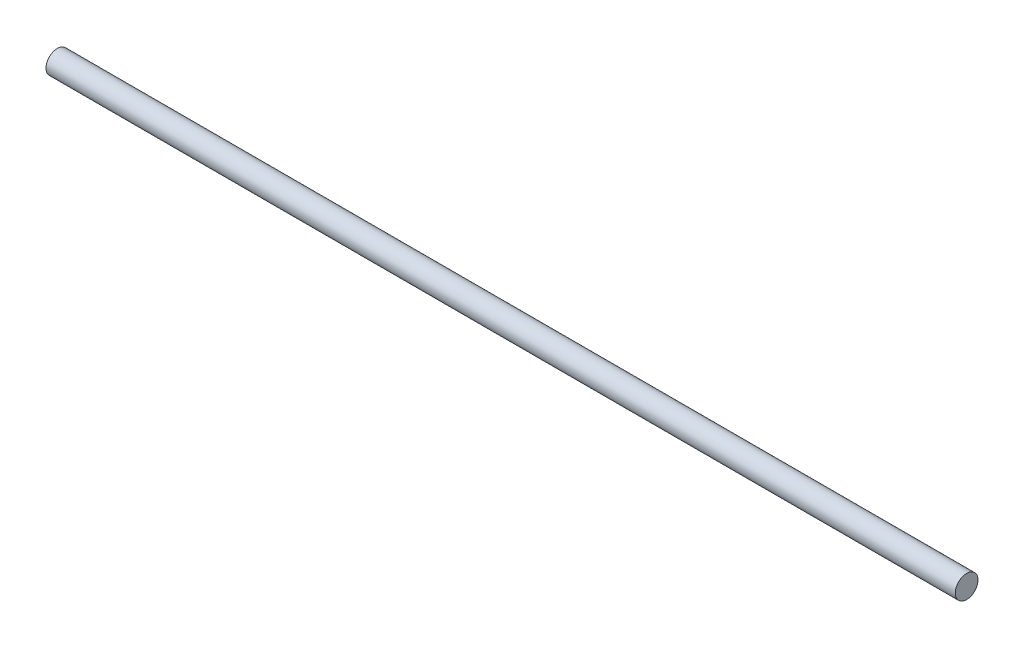
ISO-10303-21;
HEADER;
FILE_DESCRIPTION(('STEP AP214'),'2;1');
FILE_NAME('part.step','',(''),(''),'','','');
FILE_SCHEMA(('AUTOMOTIVE_DESIGN { 1 0 10303 214 1 1 1 1 }'));
ENDSEC;
DATA;
#1=APPLICATION_CONTEXT('core data for automotive mechanical design processes');
#2=APPLICATION_PROTOCOL_DEFINITION('international standard','automotive_design',2000,#1);
#3=PRODUCT_CONTEXT('',#1,'mechanical');
#4=PRODUCT('Part','Part','',(#3));
#5=PRODUCT_RELATED_PRODUCT_CATEGORY('part','',(#4));
#6=PRODUCT_DEFINITION_FORMATION('','',#4);
#7=PRODUCT_DEFINITION_CONTEXT('part definition',#1,'design');
#8=PRODUCT_DEFINITION('design','',#6,#7);
#9=PRODUCT_DEFINITION_SHAPE('','',#8);
#10=(LENGTH_UNIT() NAMED_UNIT(*) SI_UNIT(.MILLI.,.METRE.));
#11=(NAMED_UNIT(*) PLANE_ANGLE_UNIT() SI_UNIT($,.RADIAN.));
#12=(NAMED_UNIT(*) SI_UNIT($,.STERADIAN.) SOLID_ANGLE_UNIT());
#13=UNCERTAINTY_MEASURE_WITH_UNIT(LENGTH_MEASURE(1.E-05),#10,'distance_accuracy_value','');
#14=(GEOMETRIC_REPRESENTATION_CONTEXT(3) GLOBAL_UNCERTAINTY_ASSIGNED_CONTEXT((#13)) GLOBAL_UNIT_ASSIGNED_CONTEXT((#10,
#11,#12)) REPRESENTATION_CONTEXT('',''));
#15=CARTESIAN_POINT('',(0.,0.,0.));
#16=DIRECTION('',(0.,0.,1.));
#17=DIRECTION('',(1.,0.,0.));
#18=AXIS2_PLACEMENT_3D('',#15,#16,#17);
#19=CARTESIAN_POINT('',(-50.,0.,0.));
#20=DIRECTION('',(1.,0.,0.));
#21=DIRECTION('',(0.,0.,-1.));
#22=AXIS2_PLACEMENT_3D('',#19,#20,#21);
#23=CYLINDRICAL_SURFACE('',#22,1.25);
#24=CARTESIAN_POINT('',(-50.,0.,0.));
#25=DIRECTION('',(1.,0.,0.));
#26=DIRECTION('',(0.,0.,-1.));
#27=AXIS2_PLACEMENT_3D('',#24,#25,#26);
#28=CIRCLE('',#27,1.25);
#29=CARTESIAN_POINT('',(-50.,0.,-1.25));
#30=VERTEX_POINT('',#29);
#31=EDGE_CURVE('E12',#30,#30,#28,.T.);
#32=ORIENTED_EDGE('',*,*,#31,.T.);
#33=EDGE_LOOP('',(#32));
#34=FACE_BOUND('',#33,.T.);
#35=CARTESIAN_POINT('',(50.,0.,0.));
#36=DIRECTION('',(1.,0.,0.));
#37=DIRECTION('',(0.,0.,-1.));
#38=AXIS2_PLACEMENT_3D('',#35,#36,#37);
#39=CIRCLE('',#38,1.25);
#40=CARTESIAN_POINT('',(50.,0.,-1.25));
#41=VERTEX_POINT('',#40);
#42=EDGE_CURVE('E47',#41,#41,#39,.T.);
#43=ORIENTED_EDGE('',*,*,#42,.F.);
#44=EDGE_LOOP('',(#43));
#45=FACE_BOUND('',#44,.T.);
#46=ADVANCED_FACE('F41',(#34,#45),#23,.T.);
#47=CARTESIAN_POINT('',(-50.,0.,0.));
#48=DIRECTION('',(1.,0.,0.));
#49=DIRECTION('',(0.,0.,-1.));
#50=AXIS2_PLACEMENT_3D('',#47,#48,#49);
#51=PLANE('',#50);
#52=ORIENTED_EDGE('',*,*,#31,.F.);
#53=EDGE_LOOP('',(#52));
#54=FACE_BOUND('',#53,.T.);
#55=ADVANCED_FACE('F56',(#54),#51,.F.);
#56=CARTESIAN_POINT('',(50.,0.,0.));
#57=DIRECTION('',(1.,0.,0.));
#58=DIRECTION('',(0.,0.,-1.));
#59=AXIS2_PLACEMENT_3D('',#56,#57,#58);
#60=PLANE('',#59);
#61=ORIENTED_EDGE('',*,*,#42,.T.);
#62=EDGE_LOOP('',(#61));
#63=FACE_BOUND('',#62,.T.);
#64=ADVANCED_FACE('F53',(#63),#60,.T.);
#65=CLOSED_SHELL('',(#46,#55,#64));
#66=MANIFOLD_SOLID_BREP('B2',#65);
#67=ADVANCED_BREP_SHAPE_REPRESENTATION('',(#18,#66),#14);
#68=SHAPE_DEFINITION_REPRESENTATION(#9,#67);
ENDSEC;
END-ISO-10303-21;
